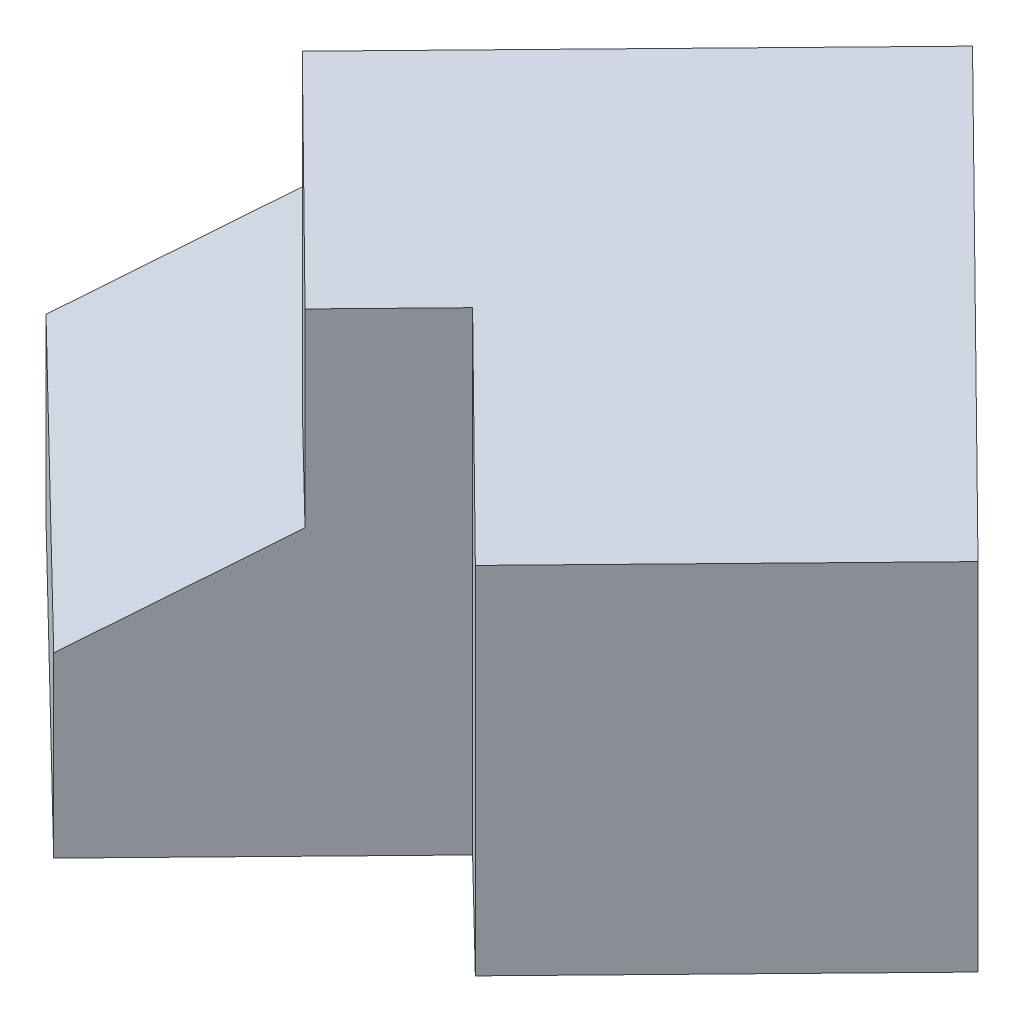
ISO-10303-21;
HEADER;
FILE_DESCRIPTION(('STEP AP214'),'2;1');
FILE_NAME('part.step','',(''),(''),'','','');
FILE_SCHEMA(('AUTOMOTIVE_DESIGN { 1 0 10303 214 1 1 1 1 }'));
ENDSEC;
DATA;
#1=APPLICATION_CONTEXT('core data for automotive mechanical design processes');
#2=APPLICATION_PROTOCOL_DEFINITION('international standard','automotive_design',2000,#1);
#3=PRODUCT_CONTEXT('',#1,'mechanical');
#4=PRODUCT('Part','Part','',(#3));
#5=PRODUCT_RELATED_PRODUCT_CATEGORY('part','',(#4));
#6=PRODUCT_DEFINITION_FORMATION('','',#4);
#7=PRODUCT_DEFINITION_CONTEXT('part definition',#1,'design');
#8=PRODUCT_DEFINITION('design','',#6,#7);
#9=PRODUCT_DEFINITION_SHAPE('','',#8);
#10=(LENGTH_UNIT() NAMED_UNIT(*) SI_UNIT(.MILLI.,.METRE.));
#11=(NAMED_UNIT(*) PLANE_ANGLE_UNIT() SI_UNIT($,.RADIAN.));
#12=(NAMED_UNIT(*) SI_UNIT($,.STERADIAN.) SOLID_ANGLE_UNIT());
#13=UNCERTAINTY_MEASURE_WITH_UNIT(LENGTH_MEASURE(1.E-05),#10,'distance_accuracy_value','');
#14=(GEOMETRIC_REPRESENTATION_CONTEXT(3) GLOBAL_UNCERTAINTY_ASSIGNED_CONTEXT((#13)) GLOBAL_UNIT_ASSIGNED_CONTEXT((#10,
#11,#12)) REPRESENTATION_CONTEXT('',''));
#15=CARTESIAN_POINT('',(0.,0.,0.));
#16=DIRECTION('',(0.,0.,1.));
#17=DIRECTION('',(1.,0.,0.));
#18=AXIS2_PLACEMENT_3D('',#15,#16,#17);
#19=CARTESIAN_POINT('',(-15.2552097362424,60.,-84.6597813362594));
#20=DIRECTION('',(-0.697760027935952,0.,0.716331587614856));
#21=DIRECTION('',(0.716331587614856,0.,0.697760027935952));
#22=AXIS2_PLACEMENT_3D('',#19,#20,#21);
#23=PLANE('',#22);
#24=DIRECTION('',(0.,1.,0.));
#25=VECTOR('',#24,1.);
#26=CARTESIAN_POINT('',(16.9797117064261,60.,-53.2605800791416));
#27=LINE('',#26,#25);
#28=CARTESIAN_POINT('',(16.9797117064261,0.,-53.2605800791416));
#29=VERTEX_POINT('',#28);
#30=CARTESIAN_POINT('',(16.9797117064261,60.,-53.2605800791416));
#31=VERTEX_POINT('',#30);
#32=EDGE_CURVE('E45',#29,#31,#27,.T.);
#33=ORIENTED_EDGE('',*,*,#32,.F.);
#34=DIRECTION('',(-0.716331587614856,0.,-0.697760027935952));
#35=VECTOR('',#34,1.);
#36=CARTESIAN_POINT('',(-15.2552097362424,0.,-84.6597813362594));
#37=LINE('',#36,#35);
#38=CARTESIAN_POINT('',(-15.2552097362424,0.,-84.6597813362594));
#39=VERTEX_POINT('',#38);
#40=EDGE_CURVE('E154',#29,#39,#37,.T.);
#41=ORIENTED_EDGE('',*,*,#40,.T.);
#42=DIRECTION('',(0.,-1.,0.));
#43=VECTOR('',#42,1.);
#44=CARTESIAN_POINT('',(-15.2552097362424,60.,-84.6597813362594));
#45=LINE('',#44,#43);
#46=CARTESIAN_POINT('',(-15.2552097362424,60.,-84.6597813362594));
#47=VERTEX_POINT('',#46);
#48=EDGE_CURVE('E164',#47,#39,#45,.T.);
#49=ORIENTED_EDGE('',*,*,#48,.F.);
#50=DIRECTION('',(-0.716331587614856,0.,-0.697760027935952));
#51=VECTOR('',#50,1.);
#52=CARTESIAN_POINT('',(-15.2552097362424,60.,-84.6597813362594));
#53=LINE('',#52,#51);
#54=EDGE_CURVE('E148',#31,#47,#53,.T.);
#55=ORIENTED_EDGE('',*,*,#54,.F.);
#56=EDGE_LOOP('',(#33,#41,#49,#55));
#57=FACE_BOUND('',#56,.T.);
#58=ADVANCED_FACE('F30',(#57),#23,.F.);
#59=CARTESIAN_POINT('',(-33.1573228068387,60.,-102.09776554947));
#60=DIRECTION('',(0.35899457268004,-0.857492925712544,-0.368549561306505));
#61=DIRECTION('',(0.,0.394871858776009,-0.918736205418498));
#62=AXIS2_PLACEMENT_3D('',#59,#60,#61);
#63=PLANE('',#62);
#64=DIRECTION('',(-0.598324287800066,-0.514495755427527,0.614249268844174));
#65=VECTOR('',#64,1.);
#66=CARTESIAN_POINT('',(16.9797117064261,60.,-53.2605800791416));
#67=LINE('',#66,#65);
#68=CARTESIAN_POINT('',(3.0245111477071,48.,-38.9339483268445));
#69=VERTEX_POINT('',#68);
#70=EDGE_CURVE('E11',#31,#69,#67,.T.);
#71=ORIENTED_EDGE('',*,*,#70,.F.);
#72=ORIENTED_EDGE('',*,*,#54,.T.);
#73=DIRECTION('',(0.598324287800066,0.514495755427527,-0.614249268844174));
#74=VECTOR('',#73,1.);
#75=CARTESIAN_POINT('',(-40.90815193977,37.9411764705882,-58.3240612033603));
#76=LINE('',#75,#74);
#77=CARTESIAN_POINT('',(-50.1432111330399,30.,-48.8432019555166));
#78=VERTEX_POINT('',#77);
#79=EDGE_CURVE('E144',#78,#47,#76,.T.);
#80=ORIENTED_EDGE('',*,*,#79,.F.);
#81=DIRECTION('',(0.716331587614856,0.,0.697760027935952));
#82=VECTOR('',#81,1.);
#83=CARTESIAN_POINT('',(-68.0453242036362,30.,-66.2811861687271));
#84=LINE('',#83,#82);
#85=CARTESIAN_POINT('',(0.,30.,0.));
#86=VERTEX_POINT('',#85);
#87=EDGE_CURVE('E142',#78,#86,#84,.T.);
#88=ORIENTED_EDGE('',*,*,#87,.T.);
#89=DIRECTION('',(0.598324287800066,0.514495755427527,-0.614249268844174));
#90=VECTOR('',#89,1.);
#91=CARTESIAN_POINT('',(34.8880013967976,60.,-35.8165793807428));
#92=LINE('',#91,#90);
#93=CARTESIAN_POINT('',(20.9328008380785,48.,-21.4899476284457));
#94=VERTEX_POINT('',#93);
#95=EDGE_CURVE('E140',#86,#94,#92,.T.);
#96=ORIENTED_EDGE('',*,*,#95,.T.);
#97=DIRECTION('',(0.716331587614856,0.,0.697760027935952));
#98=VECTOR('',#97,1.);
#99=CARTESIAN_POINT('',(-47.1125233655577,48.,-87.7711337971727));
#100=LINE('',#99,#98);
#101=EDGE_CURVE('E38',#69,#94,#100,.T.);
#102=ORIENTED_EDGE('',*,*,#101,.F.);
#103=EDGE_LOOP('',(#71,#72,#80,#88,#96,#102));
#104=FACE_BOUND('',#103,.T.);
#105=ADVANCED_FACE('F201',(#104),#63,.F.);
#106=CARTESIAN_POINT('',(34.8880013967976,60.,-35.8165793807428));
#107=DIRECTION('',(-0.716331587614856,0.,-0.697760027935952));
#108=DIRECTION('',(-0.697760027935952,0.,0.716331587614856));
#109=AXIS2_PLACEMENT_3D('',#106,#107,#108);
#110=PLANE('',#109);
#111=DIRECTION('',(0.,-1.,0.));
#112=VECTOR('',#111,1.);
#113=CARTESIAN_POINT('',(34.8880013967976,60.,-35.8165793807428));
#114=LINE('',#113,#112);
#115=CARTESIAN_POINT('',(34.8880013967976,80.,-35.8165793807428));
#116=VERTEX_POINT('',#115);
#117=CARTESIAN_POINT('',(34.8880013967976,0.,-35.8165793807428));
#118=VERTEX_POINT('',#117);
#119=EDGE_CURVE('E167',#116,#118,#114,.T.);
#120=ORIENTED_EDGE('',*,*,#119,.F.);
#121=DIRECTION('',(-0.697760027935952,0.,0.716331587614856));
#122=VECTOR('',#121,1.);
#123=CARTESIAN_POINT('',(34.8880013967976,80.,-35.8165793807428));
#124=LINE('',#123,#122);
#125=CARTESIAN_POINT('',(20.9328008380785,80.,-21.4899476284457));
#126=VERTEX_POINT('',#125);
#127=EDGE_CURVE('E188',#116,#126,#124,.T.);
#128=ORIENTED_EDGE('',*,*,#127,.T.);
#129=DIRECTION('',(0.,-1.,0.));
#130=VECTOR('',#129,1.);
#131=CARTESIAN_POINT('',(20.9328008380785,100.,-21.4899476284457));
#132=LINE('',#131,#130);
#133=EDGE_CURVE('E117',#126,#94,#132,.T.);
#134=ORIENTED_EDGE('',*,*,#133,.T.);
#135=ORIENTED_EDGE('',*,*,#95,.F.);
#136=DIRECTION('',(0.,-1.,0.));
#137=VECTOR('',#136,1.);
#138=CARTESIAN_POINT('',(0.,60.,0.));
#139=LINE('',#138,#137);
#140=CARTESIAN_POINT('',(0.,0.,0.));
#141=VERTEX_POINT('',#140);
#142=EDGE_CURVE('E150',#86,#141,#139,.T.);
#143=ORIENTED_EDGE('',*,*,#142,.T.);
#144=DIRECTION('',(0.697760027935952,0.,-0.716331587614856));
#145=VECTOR('',#144,1.);
#146=CARTESIAN_POINT('',(34.8880013967976,0.,-35.8165793807428));
#147=LINE('',#146,#145);
#148=EDGE_CURVE('E147',#141,#118,#147,.T.);
#149=ORIENTED_EDGE('',*,*,#148,.T.);
#150=EDGE_LOOP('',(#120,#128,#134,#135,#143,#149));
#151=FACE_BOUND('',#150,.T.);
#152=ADVANCED_FACE('F32',(#151),#110,.F.);
#153=CARTESIAN_POINT('',(-50.1432111330399,60.,-48.8432019555166));
#154=DIRECTION('',(0.716331587614856,0.,0.697760027935952));
#155=DIRECTION('',(0.697760027935952,0.,-0.716331587614856));
#156=AXIS2_PLACEMENT_3D('',#153,#154,#155);
#157=PLANE('',#156);
#158=DIRECTION('',(0.,-1.,0.));
#159=VECTOR('',#158,1.);
#160=CARTESIAN_POINT('',(-50.1432111330399,60.,-48.8432019555166));
#161=LINE('',#160,#159);
#162=CARTESIAN_POINT('',(-50.1432111330399,0.,-48.8432019555166));
#163=VERTEX_POINT('',#162);
#164=EDGE_CURVE('E162',#78,#163,#161,.T.);
#165=ORIENTED_EDGE('',*,*,#164,.F.);
#166=ORIENTED_EDGE('',*,*,#79,.T.);
#167=ORIENTED_EDGE('',*,*,#48,.T.);
#168=DIRECTION('',(-0.697760027935952,0.,0.716331587614856));
#169=VECTOR('',#168,1.);
#170=CARTESIAN_POINT('',(-50.1432111330399,0.,-48.8432019555166));
#171=LINE('',#170,#169);
#172=EDGE_CURVE('E156',#39,#163,#171,.T.);
#173=ORIENTED_EDGE('',*,*,#172,.T.);
#174=EDGE_LOOP('',(#165,#166,#167,#173));
#175=FACE_BOUND('',#174,.T.);
#176=ADVANCED_FACE('F199',(#175),#157,.F.);
#177=CARTESIAN_POINT('',(0.,60.,0.));
#178=DIRECTION('',(0.697760027935952,0.,-0.716331587614856));
#179=DIRECTION('',(-0.716331587614856,0.,-0.697760027935952));
#180=AXIS2_PLACEMENT_3D('',#177,#178,#179);
#181=PLANE('',#180);
#182=ORIENTED_EDGE('',*,*,#142,.F.);
#183=ORIENTED_EDGE('',*,*,#87,.F.);
#184=ORIENTED_EDGE('',*,*,#164,.T.);
#185=DIRECTION('',(0.716331587614856,0.,0.697760027935952));
#186=VECTOR('',#185,1.);
#187=CARTESIAN_POINT('',(0.,0.,0.));
#188=LINE('',#187,#186);
#189=EDGE_CURVE('E151',#163,#141,#188,.T.);
#190=ORIENTED_EDGE('',*,*,#189,.T.);
#191=EDGE_LOOP('',(#182,#183,#184,#190));
#192=FACE_BOUND('',#191,.T.);
#193=ADVANCED_FACE('F203',(#192),#181,.F.);
#194=CARTESIAN_POINT('',(0.,0.,0.));
#195=DIRECTION('',(0.,-1.,0.));
#196=DIRECTION('',(0.,0.,-1.));
#197=AXIS2_PLACEMENT_3D('',#194,#195,#196);
#198=PLANE('',#197);
#199=ORIENTED_EDGE('',*,*,#40,.F.);
#200=DIRECTION('',(-0.697760027935952,0.,0.716331587614856));
#201=VECTOR('',#200,1.);
#202=CARTESIAN_POINT('',(3.0245111477071,0.,-38.9339483268445));
#203=LINE('',#202,#201);
#204=CARTESIAN_POINT('',(58.8453133825832,0.,-96.2404753360329));
#205=VERTEX_POINT('',#204);
#206=EDGE_CURVE('E118',#205,#29,#203,.T.);
#207=ORIENTED_EDGE('',*,*,#206,.F.);
#208=DIRECTION('',(-0.716331587614856,0.,-0.697760027935951));
#209=VECTOR('',#208,1.);
#210=CARTESIAN_POINT('',(58.8453133825832,0.,-96.2404753360329));
#211=LINE('',#210,#209);
#212=CARTESIAN_POINT('',(94.6618927633261,0.,-61.3524739392354));
#213=VERTEX_POINT('',#212);
#214=EDGE_CURVE('E190',#213,#205,#211,.T.);
#215=ORIENTED_EDGE('',*,*,#214,.F.);
#216=DIRECTION('',(0.697760027935952,0.,-0.716331587614856));
#217=VECTOR('',#216,1.);
#218=CARTESIAN_POINT('',(94.6618927633261,0.,-61.3524739392354));
#219=LINE('',#218,#217);
#220=CARTESIAN_POINT('',(52.796291087169,0.,-18.372578682344));
#221=VERTEX_POINT('',#220);
#222=EDGE_CURVE('E187',#221,#213,#219,.T.);
#223=ORIENTED_EDGE('',*,*,#222,.F.);
#224=DIRECTION('',(0.716331587614856,0.,0.697760027935951));
#225=VECTOR('',#224,1.);
#226=CARTESIAN_POINT('',(52.796291087169,0.,-18.372578682344));
#227=LINE('',#226,#225);
#228=EDGE_CURVE('E175',#118,#221,#227,.T.);
#229=ORIENTED_EDGE('',*,*,#228,.F.);
#230=ORIENTED_EDGE('',*,*,#148,.F.);
#231=ORIENTED_EDGE('',*,*,#189,.F.);
#232=ORIENTED_EDGE('',*,*,#172,.F.);
#233=EDGE_LOOP('',(#199,#207,#215,#223,#229,#230,#231,#232));
#234=FACE_BOUND('',#233,.T.);
#235=ADVANCED_FACE('F184',(#234),#198,.T.);
#236=CARTESIAN_POINT('',(3.0245111477071,100.,-38.9339483268445));
#237=DIRECTION('',(0.716331587614856,0.,0.697760027935952));
#238=DIRECTION('',(0.697760027935952,0.,-0.716331587614856));
#239=AXIS2_PLACEMENT_3D('',#236,#237,#238);
#240=PLANE('',#239);
#241=ORIENTED_EDGE('',*,*,#206,.T.);
#242=ORIENTED_EDGE('',*,*,#32,.T.);
#243=ORIENTED_EDGE('',*,*,#70,.T.);
#244=DIRECTION('',(0.,-1.,0.));
#245=VECTOR('',#244,1.);
#246=CARTESIAN_POINT('',(3.0245111477071,100.,-38.9339483268445));
#247=LINE('',#246,#245);
#248=CARTESIAN_POINT('',(3.02451114770711,100.,-38.9339483268445));
#249=VERTEX_POINT('',#248);
#250=EDGE_CURVE('E124',#249,#69,#247,.T.);
#251=ORIENTED_EDGE('',*,*,#250,.F.);
#252=DIRECTION('',(-0.697760027935952,0.,0.716331587614856));
#253=VECTOR('',#252,1.);
#254=CARTESIAN_POINT('',(3.0245111477071,100.,-38.9339483268445));
#255=LINE('',#254,#253);
#256=CARTESIAN_POINT('',(58.8453133825832,100.,-96.2404753360329));
#257=VERTEX_POINT('',#256);
#258=EDGE_CURVE('E106',#257,#249,#255,.T.);
#259=ORIENTED_EDGE('',*,*,#258,.F.);
#260=DIRECTION('',(0.,-1.,0.));
#261=VECTOR('',#260,1.);
#262=CARTESIAN_POINT('',(58.8453133825832,100.,-96.2404753360329));
#263=LINE('',#262,#261);
#264=EDGE_CURVE('E129',#257,#205,#263,.T.);
#265=ORIENTED_EDGE('',*,*,#264,.T.);
#266=EDGE_LOOP('',(#241,#242,#243,#251,#259,#265));
#267=FACE_BOUND('',#266,.T.);
#268=ADVANCED_FACE('F128',(#267),#240,.F.);
#269=CARTESIAN_POINT('',(20.9328008380785,100.,-21.4899476284457));
#270=DIRECTION('',(0.697760027935952,0.,-0.716331587614856));
#271=DIRECTION('',(-0.716331587614856,0.,-0.697760027935952));
#272=AXIS2_PLACEMENT_3D('',#269,#270,#271);
#273=PLANE('',#272);
#274=ORIENTED_EDGE('',*,*,#133,.F.);
#275=DIRECTION('',(0.559360993987248,-0.624695047554424,0.544859042291282));
#276=VECTOR('',#275,1.);
#277=CARTESIAN_POINT('',(38.8410905284499,60.,-4.04594693004687));
#278=LINE('',#277,#276);
#279=EDGE_CURVE('E109',#249,#126,#278,.T.);
#280=ORIENTED_EDGE('',*,*,#279,.F.);
#281=ORIENTED_EDGE('',*,*,#250,.T.);
#282=ORIENTED_EDGE('',*,*,#101,.T.);
#283=EDGE_LOOP('',(#274,#280,#281,#282));
#284=FACE_BOUND('',#283,.T.);
#285=ADVANCED_FACE('F123',(#284),#273,.F.);
#286=CARTESIAN_POINT('',(52.796291087169,100.,-18.372578682344));
#287=DIRECTION('',(0.697760027935951,0.,-0.716331587614856));
#288=DIRECTION('',(-0.716331587614856,0.,-0.697760027935951));
#289=AXIS2_PLACEMENT_3D('',#286,#287,#288);
#290=PLANE('',#289);
#291=DIRECTION('',(0.,-1.,0.));
#292=VECTOR('',#291,1.);
#293=CARTESIAN_POINT('',(52.796291087169,100.,-18.372578682344));
#294=LINE('',#293,#292);
#295=CARTESIAN_POINT('',(52.796291087169,60.,-18.372578682344));
#296=VERTEX_POINT('',#295);
#297=EDGE_CURVE('E137',#296,#221,#294,.T.);
#298=ORIENTED_EDGE('',*,*,#297,.F.);
#299=DIRECTION('',(-0.559360993987249,0.624695047554424,-0.544859042291282));
#300=VECTOR('',#299,1.);
#301=CARTESIAN_POINT('',(38.8190893776108,75.6097560975609,-31.9874084957284));
#302=LINE('',#301,#300);
#303=EDGE_CURVE('E177',#296,#116,#302,.T.);
#304=ORIENTED_EDGE('',*,*,#303,.T.);
#305=ORIENTED_EDGE('',*,*,#119,.T.);
#306=ORIENTED_EDGE('',*,*,#228,.T.);
#307=EDGE_LOOP('',(#298,#304,#305,#306));
#308=FACE_BOUND('',#307,.T.);
#309=ADVANCED_FACE('F173',(#308),#290,.F.);
#310=CARTESIAN_POINT('',(94.6618927633261,100.,-61.3524739392354));
#311=DIRECTION('',(-0.716331587614856,0.,-0.697760027935951));
#312=DIRECTION('',(-0.697760027935952,0.,0.716331587614856));
#313=AXIS2_PLACEMENT_3D('',#310,#311,#312);
#314=PLANE('',#313);
#315=DIRECTION('',(0.,-1.,0.));
#316=VECTOR('',#315,1.);
#317=CARTESIAN_POINT('',(94.6618927633261,100.,-61.3524739392354));
#318=LINE('',#317,#316);
#319=CARTESIAN_POINT('',(94.6618927633261,60.,-61.3524739392353));
#320=VERTEX_POINT('',#319);
#321=EDGE_CURVE('E131',#320,#213,#318,.T.);
#322=ORIENTED_EDGE('',*,*,#321,.F.);
#323=DIRECTION('',(-0.697760027935952,0.,0.716331587614856));
#324=VECTOR('',#323,1.);
#325=CARTESIAN_POINT('',(108.617093322045,60.,-75.6791056915324));
#326=LINE('',#325,#324);
#327=EDGE_CURVE('E125',#320,#296,#326,.T.);
#328=ORIENTED_EDGE('',*,*,#327,.T.);
#329=ORIENTED_EDGE('',*,*,#297,.T.);
#330=ORIENTED_EDGE('',*,*,#222,.T.);
#331=EDGE_LOOP('',(#322,#328,#329,#330));
#332=FACE_BOUND('',#331,.T.);
#333=ADVANCED_FACE('F223',(#332),#314,.F.);
#334=CARTESIAN_POINT('',(58.8453133825832,100.,-96.2404753360329));
#335=DIRECTION('',(-0.697760027935951,0.,0.716331587614856));
#336=DIRECTION('',(0.716331587614856,0.,0.697760027935951));
#337=AXIS2_PLACEMENT_3D('',#334,#335,#336);
#338=PLANE('',#337);
#339=ORIENTED_EDGE('',*,*,#264,.F.);
#340=DIRECTION('',(0.559360993987249,-0.624695047554424,0.544859042291282));
#341=VECTOR('',#340,1.);
#342=CARTESIAN_POINT('',(58.8453133825832,100.,-96.2404753360329));
#343=LINE('',#342,#341);
#344=EDGE_CURVE('E112',#257,#320,#343,.T.);
#345=ORIENTED_EDGE('',*,*,#344,.T.);
#346=ORIENTED_EDGE('',*,*,#321,.T.);
#347=ORIENTED_EDGE('',*,*,#214,.T.);
#348=EDGE_LOOP('',(#339,#345,#346,#347));
#349=FACE_BOUND('',#348,.T.);
#350=ADVANCED_FACE('F226',(#349),#338,.F.);
#351=CARTESIAN_POINT('',(108.617093322045,60.,-75.6791056915324));
#352=DIRECTION('',(-0.447488795189798,-0.780868809443031,-0.435887233833025));
#353=DIRECTION('',(0.867630768291503,-0.497209060570999,0.));
#354=AXIS2_PLACEMENT_3D('',#351,#352,#353);
#355=PLANE('',#354);
#356=ORIENTED_EDGE('',*,*,#303,.F.);
#357=ORIENTED_EDGE('',*,*,#327,.F.);
#358=ORIENTED_EDGE('',*,*,#344,.F.);
#359=ORIENTED_EDGE('',*,*,#258,.T.);
#360=ORIENTED_EDGE('',*,*,#279,.T.);
#361=ORIENTED_EDGE('',*,*,#127,.F.);
#362=EDGE_LOOP('',(#356,#357,#358,#359,#360,#361));
#363=FACE_BOUND('',#362,.T.);
#364=ADVANCED_FACE('F108',(#363),#355,.F.);
#365=CLOSED_SHELL('',(#58,#105,#152,#176,#193,#235,#268,#285,#309,#333,#350,#364));
#366=MANIFOLD_SOLID_BREP('B2',#365);
#367=ADVANCED_BREP_SHAPE_REPRESENTATION('',(#18,#366),#14);
#368=SHAPE_DEFINITION_REPRESENTATION(#9,#367);
ENDSEC;
END-ISO-10303-21;
